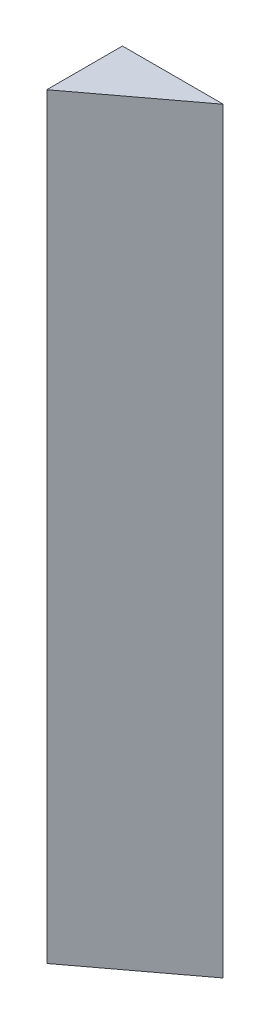
ISO-10303-21;
HEADER;
FILE_DESCRIPTION(('STEP AP214'),'2;1');
FILE_NAME('part.step','',(''),(''),'','','');
FILE_SCHEMA(('AUTOMOTIVE_DESIGN { 1 0 10303 214 1 1 1 1 }'));
ENDSEC;
DATA;
#1=APPLICATION_CONTEXT('core data for automotive mechanical design processes');
#2=APPLICATION_PROTOCOL_DEFINITION('international standard','automotive_design',2000,#1);
#3=PRODUCT_CONTEXT('',#1,'mechanical');
#4=PRODUCT('Part','Part','',(#3));
#5=PRODUCT_RELATED_PRODUCT_CATEGORY('part','',(#4));
#6=PRODUCT_DEFINITION_FORMATION('','',#4);
#7=PRODUCT_DEFINITION_CONTEXT('part definition',#1,'design');
#8=PRODUCT_DEFINITION('design','',#6,#7);
#9=PRODUCT_DEFINITION_SHAPE('','',#8);
#10=(LENGTH_UNIT() NAMED_UNIT(*) SI_UNIT(.MILLI.,.METRE.));
#11=(NAMED_UNIT(*) PLANE_ANGLE_UNIT() SI_UNIT($,.RADIAN.));
#12=(NAMED_UNIT(*) SI_UNIT($,.STERADIAN.) SOLID_ANGLE_UNIT());
#13=UNCERTAINTY_MEASURE_WITH_UNIT(LENGTH_MEASURE(1.E-05),#10,'distance_accuracy_value','');
#14=(GEOMETRIC_REPRESENTATION_CONTEXT(3) GLOBAL_UNCERTAINTY_ASSIGNED_CONTEXT((#13)) GLOBAL_UNIT_ASSIGNED_CONTEXT((#10,
#11,#12)) REPRESENTATION_CONTEXT('',''));
#15=CARTESIAN_POINT('',(0.,0.,0.));
#16=DIRECTION('',(0.,0.,1.));
#17=DIRECTION('',(1.,0.,0.));
#18=AXIS2_PLACEMENT_3D('',#15,#16,#17);
#19=CARTESIAN_POINT('',(-3.90666080275226,1.75000097971643,-2.35778278271798));
#20=DIRECTION('',(-1.74845553146952E-07,-1.,8.74227765734759E-08));
#21=DIRECTION('',(1.,-1.74845553146952E-07,0.));
#22=AXIS2_PLACEMENT_3D('',#19,#20,#21);
#23=PLANE('',#22);
#24=DIRECTION('',(0.999999999999985,-1.74845553322983E-07,0.));
#25=VECTOR('',#24,1.);
#26=CARTESIAN_POINT('',(-3.89999969402026,1.7500009791341,-2.35112167398598));
#27=LINE('',#26,#25);
#28=CARTESIAN_POINT('',(-3.89999969402026,1.7500009791331,-2.35112167398598));
#29=VERTEX_POINT('',#28);
#30=CARTESIAN_POINT('',(-3.76677751937626,1.75000095583979,-2.35112167398598));
#31=VERTEX_POINT('',#30);
#32=EDGE_CURVE('E11',#29,#31,#27,.T.);
#33=ORIENTED_EDGE('',*,*,#32,.F.);
#34=DIRECTION('',(0.,-8.74227756852966E-08,-0.999999999999996));
#35=VECTOR('',#34,1.);
#36=CARTESIAN_POINT('',(-3.89999969402026,1.75000098787638,-2.25112167398598));
#37=LINE('',#36,#35);
#38=CARTESIAN_POINT('',(-3.89999969402026,1.75000098787538,-2.25112167398598));
#39=VERTEX_POINT('',#38);
#40=EDGE_CURVE('E63',#39,#29,#37,.T.);
#41=ORIENTED_EDGE('',*,*,#40,.F.);
#42=DIRECTION('',(-0.799759704949023,1.92316091550056E-07,0.600320259811223));
#43=VECTOR('',#42,1.);
#44=CARTESIAN_POINT('',(-3.76677751937626,1.75000095584079,-2.35112167398598));
#45=LINE('',#44,#43);
#46=EDGE_CURVE('E70',#31,#39,#45,.T.);
#47=ORIENTED_EDGE('',*,*,#46,.F.);
#48=EDGE_LOOP('',(#33,#41,#47));
#49=FACE_BOUND('',#48,.T.);
#50=ADVANCED_FACE('F17',(#49),#23,.F.);
#51=CARTESIAN_POINT('',(-3.90666097759781,0.75000097971643,-2.35778269529521));
#52=DIRECTION('',(-1.74845553146952E-07,-1.,8.74227765734759E-08));
#53=DIRECTION('',(1.,-1.74845553146952E-07,0.));
#54=AXIS2_PLACEMENT_3D('',#51,#52,#53);
#55=PLANE('',#54);
#56=DIRECTION('',(-0.799759704949024,1.92316092216545E-07,0.600320259811222));
#57=VECTOR('',#56,1.);
#58=CARTESIAN_POINT('',(-3.76677769422181,0.750000955840793,-2.3511215865632));
#59=LINE('',#58,#57);
#60=CARTESIAN_POINT('',(-3.76677769422181,0.750000955841793,-2.3511215865632));
#61=VERTEX_POINT('',#60);
#62=CARTESIAN_POINT('',(-3.89999986886581,0.750000987877375,-2.25112158656321));
#63=VERTEX_POINT('',#62);
#64=EDGE_CURVE('E24',#61,#63,#59,.T.);
#65=ORIENTED_EDGE('',*,*,#64,.T.);
#66=DIRECTION('',(0.,-8.74227767955201E-08,-0.999999999999996));
#67=VECTOR('',#66,1.);
#68=CARTESIAN_POINT('',(-3.89999986886581,0.750000987876375,-2.25112158656321));
#69=LINE('',#68,#67);
#70=CARTESIAN_POINT('',(-3.89999986886581,0.750000979135098,-2.35112158656321));
#71=VERTEX_POINT('',#70);
#72=EDGE_CURVE('E49',#63,#71,#69,.T.);
#73=ORIENTED_EDGE('',*,*,#72,.T.);
#74=DIRECTION('',(0.999999999999985,-1.74845553322983E-07,0.));
#75=VECTOR('',#74,1.);
#76=CARTESIAN_POINT('',(-3.89999986886581,0.750000979134098,-2.35112158656321));
#77=LINE('',#76,#75);
#78=EDGE_CURVE('E46',#71,#61,#77,.T.);
#79=ORIENTED_EDGE('',*,*,#78,.T.);
#80=EDGE_LOOP('',(#65,#73,#79));
#81=FACE_BOUND('',#80,.T.);
#82=ADVANCED_FACE('F47',(#81),#55,.T.);
#83=CARTESIAN_POINT('',(-3.76677751937626,1.75000095584079,-2.35112167398598));
#84=DIRECTION('',(0.600320259811241,-3.50461138937884E-08,0.799759704949042));
#85=DIRECTION('',(-0.799759704949033,1.92316091942466E-07,0.600320259811229));
#86=AXIS2_PLACEMENT_3D('',#83,#84,#85);
#87=PLANE('',#86);
#88=ORIENTED_EDGE('',*,*,#46,.T.);
#89=DIRECTION('',(-1.74845553146948E-07,-0.999999999999981,8.74227765734742E-08));
#90=VECTOR('',#89,1.);
#91=CARTESIAN_POINT('',(-3.89999969402026,1.75000098787638,-2.25112167398598));
#92=LINE('',#91,#90);
#93=EDGE_CURVE('E54',#39,#63,#92,.T.);
#94=ORIENTED_EDGE('',*,*,#93,.T.);
#95=ORIENTED_EDGE('',*,*,#64,.F.);
#96=DIRECTION('',(-1.74845553146948E-07,-0.999999999999981,8.74227765734742E-08));
#97=VECTOR('',#96,1.);
#98=CARTESIAN_POINT('',(-3.76677751937626,1.75000095584079,-2.35112167398598));
#99=LINE('',#98,#97);
#100=EDGE_CURVE('E61',#31,#61,#99,.T.);
#101=ORIENTED_EDGE('',*,*,#100,.F.);
#102=EDGE_LOOP('',(#88,#94,#95,#101));
#103=FACE_BOUND('',#102,.T.);
#104=ADVANCED_FACE('F60',(#103),#87,.T.);
#105=CARTESIAN_POINT('',(-3.89999969402026,1.75000098787638,-2.25112167398598));
#106=DIRECTION('',(-1.,1.74845553146952E-07,0.));
#107=DIRECTION('',(0.,-8.74227765734759E-08,-1.));
#108=AXIS2_PLACEMENT_3D('',#105,#106,#107);
#109=PLANE('',#108);
#110=ORIENTED_EDGE('',*,*,#40,.T.);
#111=DIRECTION('',(-1.74845553146948E-07,-0.999999999999981,8.74227765734742E-08));
#112=VECTOR('',#111,1.);
#113=CARTESIAN_POINT('',(-3.89999969402026,1.7500009791341,-2.35112167398598));
#114=LINE('',#113,#112);
#115=EDGE_CURVE('E55',#29,#71,#114,.T.);
#116=ORIENTED_EDGE('',*,*,#115,.T.);
#117=ORIENTED_EDGE('',*,*,#72,.F.);
#118=ORIENTED_EDGE('',*,*,#93,.F.);
#119=EDGE_LOOP('',(#110,#116,#117,#118));
#120=FACE_BOUND('',#119,.T.);
#121=ADVANCED_FACE('F73',(#120),#109,.T.);
#122=CARTESIAN_POINT('',(-3.89999969402026,1.7500009791341,-2.35112167398598));
#123=DIRECTION('',(0.,-8.74227765734759E-08,-1.));
#124=DIRECTION('',(1.,-1.74845553146952E-07,0.));
#125=AXIS2_PLACEMENT_3D('',#122,#123,#124);
#126=PLANE('',#125);
#127=ORIENTED_EDGE('',*,*,#32,.T.);
#128=ORIENTED_EDGE('',*,*,#100,.T.);
#129=ORIENTED_EDGE('',*,*,#78,.F.);
#130=ORIENTED_EDGE('',*,*,#115,.F.);
#131=EDGE_LOOP('',(#127,#128,#129,#130));
#132=FACE_BOUND('',#131,.T.);
#133=ADVANCED_FACE('F64',(#132),#126,.T.);
#134=CLOSED_SHELL('',(#50,#82,#104,#121,#133));
#135=MANIFOLD_SOLID_BREP('B1',#134);
#136=ADVANCED_BREP_SHAPE_REPRESENTATION('',(#18,#135),#14);
#137=SHAPE_DEFINITION_REPRESENTATION(#9,#136);
ENDSEC;
END-ISO-10303-21;
